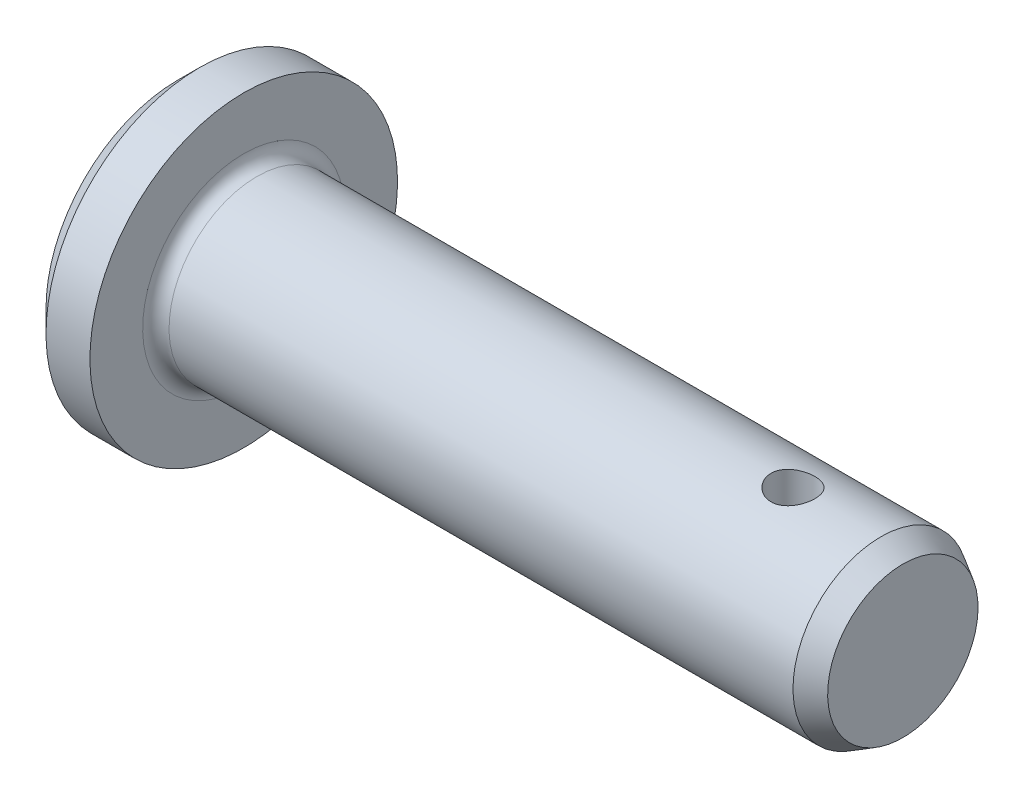
ISO-10303-21;
HEADER;
FILE_DESCRIPTION(('STEP AP214'),'2;1');
FILE_NAME('part.step','',(''),(''),'','','');
FILE_SCHEMA(('AUTOMOTIVE_DESIGN { 1 0 10303 214 1 1 1 1 }'));
ENDSEC;
DATA;
#1=APPLICATION_CONTEXT('core data for automotive mechanical design processes');
#2=APPLICATION_PROTOCOL_DEFINITION('international standard','automotive_design',2000,#1);
#3=PRODUCT_CONTEXT('',#1,'mechanical');
#4=PRODUCT('Part','Part','',(#3));
#5=PRODUCT_RELATED_PRODUCT_CATEGORY('part','',(#4));
#6=PRODUCT_DEFINITION_FORMATION('','',#4);
#7=PRODUCT_DEFINITION_CONTEXT('part definition',#1,'design');
#8=PRODUCT_DEFINITION('design','',#6,#7);
#9=PRODUCT_DEFINITION_SHAPE('','',#8);
#10=(LENGTH_UNIT() NAMED_UNIT(*) SI_UNIT(.MILLI.,.METRE.));
#11=(NAMED_UNIT(*) PLANE_ANGLE_UNIT() SI_UNIT($,.RADIAN.));
#12=(NAMED_UNIT(*) SI_UNIT($,.STERADIAN.) SOLID_ANGLE_UNIT());
#13=UNCERTAINTY_MEASURE_WITH_UNIT(LENGTH_MEASURE(1.E-05),#10,'distance_accuracy_value','');
#14=(GEOMETRIC_REPRESENTATION_CONTEXT(3) GLOBAL_UNCERTAINTY_ASSIGNED_CONTEXT((#13)) GLOBAL_UNIT_ASSIGNED_CONTEXT((#10,
#11,#12)) REPRESENTATION_CONTEXT('',''));
#15=CARTESIAN_POINT('',(0.,0.,0.));
#16=DIRECTION('',(0.,0.,1.));
#17=DIRECTION('',(1.,0.,0.));
#18=AXIS2_PLACEMENT_3D('',#15,#16,#17);
#19=CARTESIAN_POINT('',(30.,0.,0.));
#20=DIRECTION('',(1.,0.,0.));
#21=DIRECTION('',(0.,1.,0.));
#22=AXIS2_PLACEMENT_3D('',#19,#20,#21);
#23=CYLINDRICAL_SURFACE('',#22,4.);
#24=CARTESIAN_POINT('',(25.,-3.87298334620742,1.));
#25=CARTESIAN_POINT('',(25.0552203003568,-3.87298440057185,0.9999984314387));
#26=CARTESIAN_POINT('',(25.1104579594314,-3.87417722499279,0.99541049820807));
#27=CARTESIAN_POINT('',(25.2193470312326,-3.87880744892249,0.977209250194447));
#28=CARTESIAN_POINT('',(25.27299750178,-3.88224615474181,0.963590682698078));
#29=CARTESIAN_POINT('',(25.3771214152878,-3.89095489813012,0.927796479849636));
#30=CARTESIAN_POINT('',(25.4275988621578,-3.8962225706936,0.905631891140945));
#31=CARTESIAN_POINT('',(25.5241243410125,-3.90799276818327,0.853408456505409));
#32=CARTESIAN_POINT('',(25.5701721848311,-3.91449534553241,0.823349275424507));
#33=CARTESIAN_POINT('',(25.6575446581058,-3.92816286540368,0.755483370924519));
#34=CARTESIAN_POINT('',(25.6987574401403,-3.93533839048709,0.717534755081559));
#35=CARTESIAN_POINT('',(25.7743045577439,-3.94945150206622,0.635272825640329));
#36=CARTESIAN_POINT('',(25.8086382502486,-3.95638906626691,0.590958917672141));
#37=CARTESIAN_POINT('',(25.8699101870526,-3.96936166208095,0.496458080431566));
#38=CARTESIAN_POINT('',(25.8967385552646,-3.975382749602,0.446197830478045));
#39=CARTESIAN_POINT('',(25.9415238576612,-3.98572324770431,0.34170527371711));
#40=CARTESIAN_POINT('',(25.9594821007662,-3.99004290933748,0.287473554316778));
#41=CARTESIAN_POINT('',(25.9856591338314,-3.99641903539263,0.177743503501663));
#42=CARTESIAN_POINT('',(25.9940678577306,-3.99851957537723,0.12229308781959));
#43=CARTESIAN_POINT('',(26.0015033517102,-4.00037437642922,0.010731527705108));
#44=CARTESIAN_POINT('',(26.0005315088838,-4.00012898438682,-0.0453795178152275));
#45=CARTESIAN_POINT('',(25.9893700598999,-3.99735237981413,-0.155352247172388));
#46=CARTESIAN_POINT('',(25.9793854699785,-3.9948720093635,-0.209236215601067));
#47=CARTESIAN_POINT('',(25.9508114919806,-3.98796334609942,-0.314538247413687));
#48=CARTESIAN_POINT('',(25.932221645849,-3.98353494959377,-0.365956179370439));
#49=CARTESIAN_POINT('',(25.8867989717252,-3.97315003880358,-0.465406703501808));
#50=CARTESIAN_POINT('',(25.8598931821353,-3.96718007878022,-0.513404509766506));
#51=CARTESIAN_POINT('',(25.7986577283535,-3.9543596152386,-0.60427562234049));
#52=CARTESIAN_POINT('',(25.7643267725757,-3.94750895860996,-0.647148035085507));
#53=CARTESIAN_POINT('',(25.688116503207,-3.93345485507808,-0.727774035084958));
#54=CARTESIAN_POINT('',(25.6460580430609,-3.92624687810367,-0.765357679075201));
#55=CARTESIAN_POINT('',(25.5561600105839,-3.91246017406683,-0.832976375963021));
#56=CARTESIAN_POINT('',(25.5083201682036,-3.90588147642388,-0.863011076046019));
#57=CARTESIAN_POINT('',(25.4078839863404,-3.8940819873266,-0.9147881290226));
#58=CARTESIAN_POINT('',(25.3552657078747,-3.88886793490288,-0.936489566970493));
#59=CARTESIAN_POINT('',(25.2469658127694,-3.88047456055983,-0.970685620636342));
#60=CARTESIAN_POINT('',(25.1912848544067,-3.87729480324088,-0.983182206552911));
#61=CARTESIAN_POINT('',(25.0800161993907,-3.87342142415656,-0.998331855466072));
#62=CARTESIAN_POINT('',(25.0244648826681,-3.87266435637459,-1.00123618956785));
#63=CARTESIAN_POINT('',(24.9136712253687,-3.87354937392416,-0.99780679620622));
#64=CARTESIAN_POINT('',(24.8584288568195,-3.87519123840507,-0.991473919139521));
#65=CARTESIAN_POINT('',(24.7507542940181,-3.88062832781824,-0.969970185575066));
#66=CARTESIAN_POINT('',(24.6982909093717,-3.8843878809375,-0.954945627312699));
#67=CARTESIAN_POINT('',(24.5966274168593,-3.89360287308385,-0.916647232668249));
#68=CARTESIAN_POINT('',(24.5474276963779,-3.89905851299446,-0.89337241908502));
#69=CARTESIAN_POINT('',(24.4526234888531,-3.91118454837305,-0.838708267174625));
#70=CARTESIAN_POINT('',(24.4071084639828,-3.91787667442657,-0.807168701534253));
#71=CARTESIAN_POINT('',(24.3219246548795,-3.93166833228686,-0.737060292934457));
#72=CARTESIAN_POINT('',(24.28225683334,-3.93876793091388,-0.698490294805441));
#73=CARTESIAN_POINT('',(24.2088755829716,-3.95278961212643,-0.614262720984727));
#74=CARTESIAN_POINT('',(24.1753359749805,-3.95970280824734,-0.568451952531595));
#75=CARTESIAN_POINT('',(24.1164256532195,-3.97238886645494,-0.471702682694677));
#76=CARTESIAN_POINT('',(24.0910545133567,-3.97816178801584,-0.420764448957592));
#77=CARTESIAN_POINT('',(24.0494215861888,-3.98788046295326,-0.315558201731091));
#78=CARTESIAN_POINT('',(24.0330942862484,-3.99183932008964,-0.261317381027882));
#79=CARTESIAN_POINT('',(24.0098158661566,-3.99754117358315,-0.150749760318808));
#80=CARTESIAN_POINT('',(24.0028629365044,-3.99928459757364,-0.0944233650412438));
#81=CARTESIAN_POINT('',(23.9986324104245,-4.00034169408811,0.0170835264433261));
#82=CARTESIAN_POINT('',(24.0010982909046,-3.99971978880009,0.0722538269660327));
#83=CARTESIAN_POINT('',(24.0150478272943,-3.99625896457424,0.181367496414739));
#84=CARTESIAN_POINT('',(24.0265312150131,-3.99342011157095,0.235310901780887));
#85=CARTESIAN_POINT('',(24.0580522197709,-3.98585432853963,0.340171035644816));
#86=CARTESIAN_POINT('',(24.0780434533146,-3.98113764502669,0.391102494581018));
#87=CARTESIAN_POINT('',(24.1259705790193,-3.97031288913382,0.488917053041468));
#88=CARTESIAN_POINT('',(24.1539074726696,-3.96420464137727,0.535799641265051));
#89=CARTESIAN_POINT('',(24.2177152339971,-3.95107249681343,0.625401928423901));
#90=CARTESIAN_POINT('',(24.2537601429074,-3.94403016945647,0.667994988300588));
#91=CARTESIAN_POINT('',(24.3324228519738,-3.92990649053207,0.746615020271252));
#92=CARTESIAN_POINT('',(24.3750423160979,-3.92282512952424,0.782640325068178));
#93=CARTESIAN_POINT('',(24.4666014142013,-3.90927475860683,0.847762026479241));
#94=CARTESIAN_POINT('',(24.5156441234125,-3.90281963730391,0.876716619446595));
#95=CARTESIAN_POINT('',(24.6180554899228,-3.8914395555011,0.925926896615624));
#96=CARTESIAN_POINT('',(24.6714209661073,-3.88651348244814,0.946188909759558));
#97=CARTESIAN_POINT('',(24.7705770118263,-3.87951908741315,0.974422528565573));
#98=CARTESIAN_POINT('',(24.8158931643824,-3.87708663005761,0.98399317059583));
#99=CARTESIAN_POINT('',(24.9074688690015,-3.87381838580358,0.996782292572821));
#100=CARTESIAN_POINT('',(24.9537283402506,-3.87298246270639,1.00000131437052));
#101=CARTESIAN_POINT('',(25.,-3.87298334620742,1.));
#102=B_SPLINE_CURVE_WITH_KNOTS('',3,(#24,#25,#26,#27,#28,#29,#30,#31,#32,#33,#34,#35,#36,#37,
#38,#39,#40,#41,#42,#43,#44,#45,#46,#47,#48,#49,#50,#51,#52,#53,#54,#55,#56,#57,#58,#59,#60,#61,
#62,#63,#64,#65,#66,#67,#68,#69,#70,#71,#72,#73,#74,#75,#76,#77,#78,#79,#80,#81,#82,#83,#84,#85,
#86,#87,#88,#89,#90,#91,#92,#93,#94,#95,#96,#97,#98,#99,#100,#101),.UNSPECIFIED.,.T.,.F.,(4,2,2,
2,2,2,2,2,2,2,2,2,2,2,2,2,2,2,2,2,2,2,2,2,2,2,2,2,2,2,2,2,2,2,2,2,2,2,4),(0.,0.165490976675234,
0.331078296534212,0.496452290829149,0.66183330698466,0.83049581673465,0.999174085882213,
1.17020598555443,1.34121263935112,1.50875500394413,1.67627259462683,1.84007305071854,
2.00388222686189,2.16917149698053,2.3344895418384,2.5042818662504,2.67408212476196,
2.84470572799636,3.01529280048094,3.18137429900962,3.34744050869796,3.51078961999958,
3.67415808564842,3.84073138339938,4.00733207550293,4.17810132382403,4.34886166284096,
4.51836829119047,4.6878421955989,4.85273378447258,5.01762046947068,5.18161950620159,
5.34563922291504,5.51358838629103,5.68158012622479,5.85270590910146,6.02370688542923,
6.16239130867207,6.30106390036084),.UNSPECIFIED.);
#103=CARTESIAN_POINT('',(25.,-3.87298334620742,1.));
#104=VERTEX_POINT('',#103);
#105=EDGE_CURVE('E68',#104,#104,#102,.T.);
#106=ORIENTED_EDGE('',*,*,#105,.T.);
#107=EDGE_LOOP('',(#106));
#108=FACE_BOUND('',#107,.T.);
#109=CARTESIAN_POINT('',(0.6,0.,0.));
#110=DIRECTION('',(1.,0.,0.));
#111=DIRECTION('',(0.,1.,0.));
#112=AXIS2_PLACEMENT_3D('',#109,#110,#111);
#113=CIRCLE('',#112,4.);
#114=CARTESIAN_POINT('',(0.6,4.,0.));
#115=VERTEX_POINT('',#114);
#116=EDGE_CURVE('E38',#115,#115,#113,.T.);
#117=ORIENTED_EDGE('',*,*,#116,.T.);
#118=EDGE_LOOP('',(#117));
#119=FACE_BOUND('',#118,.T.);
#120=CARTESIAN_POINT('',(29.,0.,0.));
#121=DIRECTION('',(1.,0.,0.));
#122=DIRECTION('',(0.,1.,0.));
#123=AXIS2_PLACEMENT_3D('',#120,#121,#122);
#124=CIRCLE('',#123,4.);
#125=CARTESIAN_POINT('',(29.,4.,0.));
#126=VERTEX_POINT('',#125);
#127=EDGE_CURVE('E54',#126,#126,#124,.T.);
#128=ORIENTED_EDGE('',*,*,#127,.F.);
#129=EDGE_LOOP('',(#128));
#130=FACE_BOUND('',#129,.T.);
#131=CARTESIAN_POINT('',(25.,3.87298334620742,-1.));
#132=CARTESIAN_POINT('',(24.9447796996432,3.87298440057185,-0.9999984314387));
#133=CARTESIAN_POINT('',(24.8895420405686,3.87417722499279,-0.99541049820807));
#134=CARTESIAN_POINT('',(24.7806529687674,3.87880744892249,-0.977209250194447));
#135=CARTESIAN_POINT('',(24.72700249822,3.88224615474181,-0.963590682698078));
#136=CARTESIAN_POINT('',(24.6228785847122,3.89095489813012,-0.927796479849635));
#137=CARTESIAN_POINT('',(24.5724011378422,3.8962225706936,-0.905631891140943));
#138=CARTESIAN_POINT('',(24.4758756589875,3.90799276818327,-0.853408456505406));
#139=CARTESIAN_POINT('',(24.4298278151688,3.91449534553241,-0.823349275424506));
#140=CARTESIAN_POINT('',(24.3424553418941,3.92816286540368,-0.755483370924519));
#141=CARTESIAN_POINT('',(24.3012425598597,3.93533839048709,-0.717534755081559));
#142=CARTESIAN_POINT('',(24.2256954422561,3.94945150206622,-0.635272825640329));
#143=CARTESIAN_POINT('',(24.1913617497514,3.95638906626691,-0.590958917672141));
#144=CARTESIAN_POINT('',(24.1300898129474,3.96936166208095,-0.496458080431566));
#145=CARTESIAN_POINT('',(24.1032614447354,3.975382749602,-0.446197830478045));
#146=CARTESIAN_POINT('',(24.0584761423388,3.98572324770431,-0.34170527371711));
#147=CARTESIAN_POINT('',(24.0405178992338,3.99004290933748,-0.287473554316778));
#148=CARTESIAN_POINT('',(24.0143408661686,3.99641903539263,-0.177743503501663));
#149=CARTESIAN_POINT('',(24.0059321422694,3.99851957537723,-0.12229308781959));
#150=CARTESIAN_POINT('',(23.9984966482898,4.00037437642922,-0.010731527705108));
#151=CARTESIAN_POINT('',(23.9994684911162,4.00012898438682,0.0453795178152275));
#152=CARTESIAN_POINT('',(24.0106299401001,3.99735237981413,0.155352247172388));
#153=CARTESIAN_POINT('',(24.0206145300215,3.9948720093635,0.209236215601067));
#154=CARTESIAN_POINT('',(24.0491885080194,3.98796334609942,0.314538247413687));
#155=CARTESIAN_POINT('',(24.067778354151,3.98353494959377,0.365956179370439));
#156=CARTESIAN_POINT('',(24.1132010282748,3.97315003880358,0.465406703501807));
#157=CARTESIAN_POINT('',(24.1401068178647,3.96718007878022,0.513404509766505));
#158=CARTESIAN_POINT('',(24.2013422716465,3.9543596152386,0.604275622340489));
#159=CARTESIAN_POINT('',(24.2356732274242,3.94750895860996,0.647148035085506));
#160=CARTESIAN_POINT('',(24.3118834967929,3.93345485507808,0.727774035084958));
#161=CARTESIAN_POINT('',(24.3539419569391,3.92624687810367,0.765357679075201));
#162=CARTESIAN_POINT('',(24.4438399894161,3.91246017406683,0.832976375963021));
#163=CARTESIAN_POINT('',(24.4916798317964,3.90588147642388,0.863011076046019));
#164=CARTESIAN_POINT('',(24.5921160136596,3.8940819873266,0.9147881290226));
#165=CARTESIAN_POINT('',(24.6447342921253,3.88886793490288,0.936489566970493));
#166=CARTESIAN_POINT('',(24.7530341872306,3.88047456055983,0.970685620636342));
#167=CARTESIAN_POINT('',(24.8087151455932,3.87729480324088,0.983182206552911));
#168=CARTESIAN_POINT('',(24.9199838006092,3.87342142415656,0.998331855466072));
#169=CARTESIAN_POINT('',(24.9755351173318,3.87266435637459,1.00123618956785));
#170=CARTESIAN_POINT('',(25.0863287746313,3.87354937392416,0.99780679620622));
#171=CARTESIAN_POINT('',(25.1415711431805,3.87519123840507,0.991473919139521));
#172=CARTESIAN_POINT('',(25.2492457059819,3.88062832781824,0.969970185575066));
#173=CARTESIAN_POINT('',(25.3017090906283,3.8843878809375,0.954945627312699));
#174=CARTESIAN_POINT('',(25.4033725831407,3.89360287308385,0.916647232668249));
#175=CARTESIAN_POINT('',(25.4525723036221,3.89905851299446,0.89337241908502));
#176=CARTESIAN_POINT('',(25.5473765111469,3.91118454837305,0.838708267174625));
#177=CARTESIAN_POINT('',(25.5928915360172,3.91787667442657,0.807168701534253));
#178=CARTESIAN_POINT('',(25.6780753451205,3.93166833228686,0.737060292934457));
#179=CARTESIAN_POINT('',(25.71774316666,3.93876793091388,0.698490294805441));
#180=CARTESIAN_POINT('',(25.7911244170284,3.95278961212643,0.614262720984727));
#181=CARTESIAN_POINT('',(25.8246640250195,3.95970280824734,0.568451952531595));
#182=CARTESIAN_POINT('',(25.8835743467805,3.97238886645494,0.471702682694677));
#183=CARTESIAN_POINT('',(25.9089454866433,3.97816178801584,0.420764448957592));
#184=CARTESIAN_POINT('',(25.9505784138112,3.98788046295326,0.315558201731091));
#185=CARTESIAN_POINT('',(25.9669057137516,3.99183932008964,0.261317381027882));
#186=CARTESIAN_POINT('',(25.9901841338434,3.99754117358315,0.150749760318808));
#187=CARTESIAN_POINT('',(25.9971370634956,3.99928459757364,0.0944233650412438));
#188=CARTESIAN_POINT('',(26.0013675895755,4.00034169408811,-0.0170835264433261));
#189=CARTESIAN_POINT('',(25.9989017090954,3.99971978880009,-0.0722538269660327));
#190=CARTESIAN_POINT('',(25.9849521727057,3.99625896457424,-0.181367496414739));
#191=CARTESIAN_POINT('',(25.9734687849869,3.99342011157095,-0.235310901780887));
#192=CARTESIAN_POINT('',(25.9419477802291,3.98585432853963,-0.340171035644816));
#193=CARTESIAN_POINT('',(25.9219565466854,3.98113764502669,-0.391102494581018));
#194=CARTESIAN_POINT('',(25.8740294209807,3.97031288913382,-0.488917053041468));
#195=CARTESIAN_POINT('',(25.8460925273304,3.96420464137727,-0.535799641265051));
#196=CARTESIAN_POINT('',(25.7822847660029,3.95107249681343,-0.625401928423901));
#197=CARTESIAN_POINT('',(25.7462398570926,3.94403016945647,-0.667994988300588));
#198=CARTESIAN_POINT('',(25.6675771480262,3.92990649053207,-0.746615020271252));
#199=CARTESIAN_POINT('',(25.624957683902,3.92282512952424,-0.782640325068178));
#200=CARTESIAN_POINT('',(25.5333985857987,3.90927475860683,-0.847762026479241));
#201=CARTESIAN_POINT('',(25.4843558765875,3.90281963730391,-0.876716619446595));
#202=CARTESIAN_POINT('',(25.3819445100771,3.8914395555011,-0.925926896615624));
#203=CARTESIAN_POINT('',(25.3285790338927,3.88651348244814,-0.946188909759558));
#204=CARTESIAN_POINT('',(25.2294229881737,3.87951908741315,-0.974422528565573));
#205=CARTESIAN_POINT('',(25.1841068356176,3.87708663005761,-0.98399317059583));
#206=CARTESIAN_POINT('',(25.0925311309985,3.87381838580358,-0.996782292572821));
#207=CARTESIAN_POINT('',(25.0462716597494,3.87298246270639,-1.00000131437052));
#208=CARTESIAN_POINT('',(25.,3.87298334620742,-1.));
#209=B_SPLINE_CURVE_WITH_KNOTS('',3,(#131,#132,#133,#134,#135,#136,#137,#138,#139,#140,#141,
#142,#143,#144,#145,#146,#147,#148,#149,#150,#151,#152,#153,#154,#155,#156,#157,#158,#159,#160,
#161,#162,#163,#164,#165,#166,#167,#168,#169,#170,#171,#172,#173,#174,#175,#176,#177,#178,#179,
#180,#181,#182,#183,#184,#185,#186,#187,#188,#189,#190,#191,#192,#193,#194,#195,#196,#197,#198,
#199,#200,#201,#202,#203,#204,#205,#206,#207,#208),.UNSPECIFIED.,.T.,.F.,(4,2,2,2,2,2,2,2,2,2,2,
2,2,2,2,2,2,2,2,2,2,2,2,2,2,2,2,2,2,2,2,2,2,2,2,2,2,2,4),(0.,0.165490976675234,
0.331078296534212,0.496452290829157,0.66183330698466,0.83049581673465,0.999174085882213,
1.17020598555443,1.34121263935112,1.50875500394413,1.67627259462683,1.84007305071854,
2.00388222686189,2.16917149698053,2.3344895418384,2.5042818662504,2.67408212476196,
2.84470572799636,3.01529280048094,3.18137429900962,3.34744050869796,3.51078961999958,
3.67415808564842,3.84073138339938,4.00733207550293,4.17810132382403,4.34886166284096,
4.51836829119047,4.6878421955989,4.85273378447258,5.01762046947068,5.18161950620159,
5.34563922291504,5.51358838629103,5.68158012622479,5.85270590910146,6.02370688542923,
6.16239130867207,6.30106390036084),.UNSPECIFIED.);
#210=CARTESIAN_POINT('',(25.,3.87298334620742,-1.));
#211=VERTEX_POINT('',#210);
#212=EDGE_CURVE('E60',#211,#211,#209,.T.);
#213=ORIENTED_EDGE('',*,*,#212,.F.);
#214=EDGE_LOOP('',(#213));
#215=FACE_BOUND('',#214,.T.);
#216=ADVANCED_FACE('F31',(#108,#119,#130,#215),#23,.T.);
#217=CARTESIAN_POINT('',(-3.,0.,0.));
#218=DIRECTION('',(-1.,0.,0.));
#219=DIRECTION('',(0.,-1.,0.));
#220=AXIS2_PLACEMENT_3D('',#217,#218,#219);
#221=PLANE('',#220);
#222=CARTESIAN_POINT('',(-3.,0.,0.));
#223=DIRECTION('',(1.,0.,0.));
#224=DIRECTION('',(0.,1.,0.));
#225=AXIS2_PLACEMENT_3D('',#222,#223,#224);
#226=CIRCLE('',#225,5.99999999999999);
#227=CARTESIAN_POINT('',(-3.,5.99999999999999,0.));
#228=VERTEX_POINT('',#227);
#229=EDGE_CURVE('E42',#228,#228,#226,.T.);
#230=ORIENTED_EDGE('',*,*,#229,.F.);
#231=EDGE_LOOP('',(#230));
#232=FACE_BOUND('',#231,.T.);
#233=ADVANCED_FACE('F93',(#232),#221,.T.);
#234=CARTESIAN_POINT('',(-2.,0.,0.));
#235=DIRECTION('',(1.,0.,0.));
#236=DIRECTION('',(0.,1.,0.));
#237=AXIS2_PLACEMENT_3D('',#234,#235,#236);
#238=CONICAL_SURFACE('',#237,7.,0.785398163397453);
#239=ORIENTED_EDGE('',*,*,#229,.T.);
#240=EDGE_LOOP('',(#239));
#241=FACE_BOUND('',#240,.T.);
#242=CARTESIAN_POINT('',(-2.,0.,0.));
#243=DIRECTION('',(1.,0.,0.));
#244=DIRECTION('',(0.,1.,0.));
#245=AXIS2_PLACEMENT_3D('',#242,#243,#244);
#246=CIRCLE('',#245,7.);
#247=CARTESIAN_POINT('',(-2.,7.,0.));
#248=VERTEX_POINT('',#247);
#249=EDGE_CURVE('E46',#248,#248,#246,.T.);
#250=ORIENTED_EDGE('',*,*,#249,.F.);
#251=EDGE_LOOP('',(#250));
#252=FACE_BOUND('',#251,.T.);
#253=ADVANCED_FACE('F100',(#241,#252),#238,.T.);
#254=CARTESIAN_POINT('',(30.,0.,0.));
#255=DIRECTION('',(1.,0.,0.));
#256=DIRECTION('',(0.,1.,0.));
#257=AXIS2_PLACEMENT_3D('',#254,#255,#256);
#258=CYLINDRICAL_SURFACE('',#257,7.);
#259=ORIENTED_EDGE('',*,*,#249,.T.);
#260=EDGE_LOOP('',(#259));
#261=FACE_BOUND('',#260,.T.);
#262=CARTESIAN_POINT('',(0.,0.,0.));
#263=DIRECTION('',(1.,0.,0.));
#264=DIRECTION('',(0.,1.,0.));
#265=AXIS2_PLACEMENT_3D('',#262,#263,#264);
#266=CIRCLE('',#265,7.);
#267=CARTESIAN_POINT('',(0.,7.,0.));
#268=VERTEX_POINT('',#267);
#269=EDGE_CURVE('E51',#268,#268,#266,.T.);
#270=ORIENTED_EDGE('',*,*,#269,.F.);
#271=EDGE_LOOP('',(#270));
#272=FACE_BOUND('',#271,.T.);
#273=ADVANCED_FACE('F97',(#261,#272),#258,.T.);
#274=CARTESIAN_POINT('',(0.,7.,0.));
#275=DIRECTION('',(1.,0.,0.));
#276=DIRECTION('',(0.,1.,0.));
#277=AXIS2_PLACEMENT_3D('',#274,#275,#276);
#278=PLANE('',#277);
#279=CARTESIAN_POINT('',(0.,0.,0.));
#280=DIRECTION('',(1.,0.,0.));
#281=DIRECTION('',(0.,1.,0.));
#282=AXIS2_PLACEMENT_3D('',#279,#280,#281);
#283=CIRCLE('',#282,4.6);
#284=CARTESIAN_POINT('',(0.,4.6,0.));
#285=VERTEX_POINT('',#284);
#286=EDGE_CURVE('E10',#285,#285,#283,.F.);
#287=ORIENTED_EDGE('',*,*,#286,.T.);
#288=EDGE_LOOP('',(#287));
#289=FACE_BOUND('',#288,.T.);
#290=ORIENTED_EDGE('',*,*,#269,.T.);
#291=EDGE_LOOP('',(#290));
#292=FACE_BOUND('',#291,.T.);
#293=ADVANCED_FACE('F89',(#289,#292),#278,.T.);
#294=CARTESIAN_POINT('',(30.,0.,0.));
#295=DIRECTION('',(-1.,0.,0.));
#296=DIRECTION('',(0.,-1.,0.));
#297=AXIS2_PLACEMENT_3D('',#294,#295,#296);
#298=CONICAL_SURFACE('',#297,3.42264973081037,0.523598775598304);
#299=ORIENTED_EDGE('',*,*,#127,.T.);
#300=EDGE_LOOP('',(#299));
#301=FACE_BOUND('',#300,.T.);
#302=CARTESIAN_POINT('',(30.,0.,0.));
#303=DIRECTION('',(1.,0.,0.));
#304=DIRECTION('',(0.,1.,0.));
#305=AXIS2_PLACEMENT_3D('',#302,#303,#304);
#306=CIRCLE('',#305,3.42264973081037);
#307=CARTESIAN_POINT('',(30.,3.42264973081037,0.));
#308=VERTEX_POINT('',#307);
#309=EDGE_CURVE('E57',#308,#308,#306,.T.);
#310=ORIENTED_EDGE('',*,*,#309,.F.);
#311=EDGE_LOOP('',(#310));
#312=FACE_BOUND('',#311,.T.);
#313=ADVANCED_FACE('F85',(#301,#312),#298,.T.);
#314=CARTESIAN_POINT('',(30.,3.42264973081037,0.));
#315=DIRECTION('',(1.,0.,0.));
#316=DIRECTION('',(0.,1.,0.));
#317=AXIS2_PLACEMENT_3D('',#314,#315,#316);
#318=PLANE('',#317);
#319=ORIENTED_EDGE('',*,*,#309,.T.);
#320=EDGE_LOOP('',(#319));
#321=FACE_BOUND('',#320,.T.);
#322=ADVANCED_FACE('F82',(#321),#318,.T.);
#323=CARTESIAN_POINT('',(0.6,0.,0.));
#324=DIRECTION('',(1.,0.,0.));
#325=DIRECTION('',(0.,1.,0.));
#326=AXIS2_PLACEMENT_3D('',#323,#324,#325);
#327=TOROIDAL_SURFACE('',#326,4.6,0.6);
#328=ORIENTED_EDGE('',*,*,#286,.F.);
#329=EDGE_LOOP('',(#328));
#330=FACE_BOUND('',#329,.T.);
#331=ORIENTED_EDGE('',*,*,#116,.F.);
#332=EDGE_LOOP('',(#331));
#333=FACE_BOUND('',#332,.T.);
#334=ADVANCED_FACE('F33',(#330,#333),#327,.F.);
#335=CARTESIAN_POINT('',(25.,7.001,0.));
#336=DIRECTION('',(0.,-1.,0.));
#337=DIRECTION('',(0.,0.,-1.));
#338=AXIS2_PLACEMENT_3D('',#335,#336,#337);
#339=CYLINDRICAL_SURFACE('',#338,1.);
#340=ORIENTED_EDGE('',*,*,#212,.T.);
#341=EDGE_LOOP('',(#340));
#342=FACE_BOUND('',#341,.T.);
#343=ORIENTED_EDGE('',*,*,#105,.F.);
#344=EDGE_LOOP('',(#343));
#345=FACE_BOUND('',#344,.T.);
#346=ADVANCED_FACE('F74',(#342,#345),#339,.F.);
#347=CLOSED_SHELL('',(#216,#233,#253,#273,#293,#313,#322,#334,#346));
#348=MANIFOLD_SOLID_BREP('B2',#347);
#349=ADVANCED_BREP_SHAPE_REPRESENTATION('',(#18,#348),#14);
#350=SHAPE_DEFINITION_REPRESENTATION(#9,#349);
ENDSEC;
END-ISO-10303-21;
